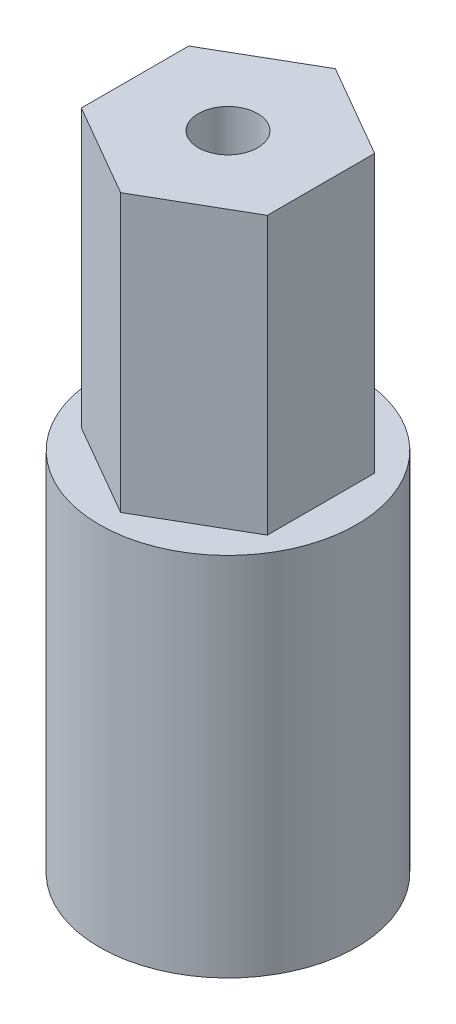
ISO-10303-21;
HEADER;
FILE_DESCRIPTION(('STEP AP214'),'2;1');
FILE_NAME('part.step','',(''),(''),'','','');
FILE_SCHEMA(('AUTOMOTIVE_DESIGN { 1 0 10303 214 1 1 1 1 }'));
ENDSEC;
DATA;
#1=APPLICATION_CONTEXT('core data for automotive mechanical design processes');
#2=APPLICATION_PROTOCOL_DEFINITION('international standard','automotive_design',2000,#1);
#3=PRODUCT_CONTEXT('',#1,'mechanical');
#4=PRODUCT('Part','Part','',(#3));
#5=PRODUCT_RELATED_PRODUCT_CATEGORY('part','',(#4));
#6=PRODUCT_DEFINITION_FORMATION('','',#4);
#7=PRODUCT_DEFINITION_CONTEXT('part definition',#1,'design');
#8=PRODUCT_DEFINITION('design','',#6,#7);
#9=PRODUCT_DEFINITION_SHAPE('','',#8);
#10=(LENGTH_UNIT() NAMED_UNIT(*) SI_UNIT(.MILLI.,.METRE.));
#11=(NAMED_UNIT(*) PLANE_ANGLE_UNIT() SI_UNIT($,.RADIAN.));
#12=(NAMED_UNIT(*) SI_UNIT($,.STERADIAN.) SOLID_ANGLE_UNIT());
#13=UNCERTAINTY_MEASURE_WITH_UNIT(LENGTH_MEASURE(1.E-05),#10,'distance_accuracy_value','');
#14=(GEOMETRIC_REPRESENTATION_CONTEXT(3) GLOBAL_UNCERTAINTY_ASSIGNED_CONTEXT((#13)) GLOBAL_UNIT_ASSIGNED_CONTEXT((#10,
#11,#12)) REPRESENTATION_CONTEXT('',''));
#15=CARTESIAN_POINT('',(0.,0.,0.));
#16=DIRECTION('',(0.,0.,1.));
#17=DIRECTION('',(1.,0.,0.));
#18=AXIS2_PLACEMENT_3D('',#15,#16,#17);
#19=CARTESIAN_POINT('',(0.,23.495,0.));
#20=DIRECTION('',(0.,-1.,0.));
#21=DIRECTION('',(0.,0.,-1.));
#22=AXIS2_PLACEMENT_3D('',#19,#20,#21);
#23=CYLINDRICAL_SURFACE('',#22,8.255);
#24=CARTESIAN_POINT('',(0.,23.495,0.));
#25=DIRECTION('',(0.,1.,0.));
#26=DIRECTION('',(0.,0.,1.));
#27=AXIS2_PLACEMENT_3D('',#24,#25,#26);
#28=CIRCLE('',#27,8.255);
#29=CARTESIAN_POINT('',(0.,23.495,8.255));
#30=VERTEX_POINT('',#29);
#31=EDGE_CURVE('E39',#30,#30,#28,.T.);
#32=ORIENTED_EDGE('',*,*,#31,.F.);
#33=EDGE_LOOP('',(#32));
#34=FACE_BOUND('',#33,.T.);
#35=CARTESIAN_POINT('',(0.,0.,0.));
#36=DIRECTION('',(0.,1.,0.));
#37=DIRECTION('',(0.,0.,1.));
#38=AXIS2_PLACEMENT_3D('',#35,#36,#37);
#39=CIRCLE('',#38,8.255);
#40=CARTESIAN_POINT('',(0.,0.,8.255));
#41=VERTEX_POINT('',#40);
#42=EDGE_CURVE('E137',#41,#41,#39,.T.);
#43=ORIENTED_EDGE('',*,*,#42,.T.);
#44=EDGE_LOOP('',(#43));
#45=FACE_BOUND('',#44,.T.);
#46=ADVANCED_FACE('F32',(#34,#45),#23,.T.);
#47=CARTESIAN_POINT('',(0.,23.495,0.));
#48=DIRECTION('',(0.,1.,0.));
#49=DIRECTION('',(0.,0.,1.));
#50=AXIS2_PLACEMENT_3D('',#47,#48,#49);
#51=PLANE('',#50);
#52=DIRECTION('',(-0.866025403784439,0.,0.5));
#53=VECTOR('',#52,1.);
#54=CARTESIAN_POINT('',(0.,23.495,-6.89240751358575));
#55=LINE('',#54,#53);
#56=CARTESIAN_POINT('',(0.,23.495,-6.89240751358575));
#57=VERTEX_POINT('',#56);
#58=CARTESIAN_POINT('',(-5.969,23.495,-3.44620375679288));
#59=VERTEX_POINT('',#58);
#60=EDGE_CURVE('E119',#57,#59,#55,.T.);
#61=ORIENTED_EDGE('',*,*,#60,.F.);
#62=DIRECTION('',(-0.866025403784439,0.,-0.5));
#63=VECTOR('',#62,1.);
#64=CARTESIAN_POINT('',(5.969,23.495,-3.44620375679288));
#65=LINE('',#64,#63);
#66=CARTESIAN_POINT('',(5.969,23.495,-3.44620375679288));
#67=VERTEX_POINT('',#66);
#68=EDGE_CURVE('E116',#67,#57,#65,.T.);
#69=ORIENTED_EDGE('',*,*,#68,.F.);
#70=DIRECTION('',(0.,0.,-1.));
#71=VECTOR('',#70,1.);
#72=CARTESIAN_POINT('',(5.969,23.495,3.44620375679288));
#73=LINE('',#72,#71);
#74=CARTESIAN_POINT('',(5.969,23.495,3.44620375679288));
#75=VERTEX_POINT('',#74);
#76=EDGE_CURVE('E74',#75,#67,#73,.T.);
#77=ORIENTED_EDGE('',*,*,#76,.F.);
#78=DIRECTION('',(0.866025403784439,0.,-0.5));
#79=VECTOR('',#78,1.);
#80=CARTESIAN_POINT('',(0.,23.495,6.89240751358575));
#81=LINE('',#80,#79);
#82=CARTESIAN_POINT('',(0.,23.495,6.89240751358575));
#83=VERTEX_POINT('',#82);
#84=EDGE_CURVE('E125',#83,#75,#81,.T.);
#85=ORIENTED_EDGE('',*,*,#84,.F.);
#86=DIRECTION('',(0.866025403784439,0.,0.5));
#87=VECTOR('',#86,1.);
#88=CARTESIAN_POINT('',(-5.969,23.495,3.44620375679288));
#89=LINE('',#88,#87);
#90=CARTESIAN_POINT('',(-5.969,23.495,3.44620375679288));
#91=VERTEX_POINT('',#90);
#92=EDGE_CURVE('E105',#91,#83,#89,.T.);
#93=ORIENTED_EDGE('',*,*,#92,.F.);
#94=DIRECTION('',(0.,0.,1.));
#95=VECTOR('',#94,1.);
#96=CARTESIAN_POINT('',(-5.969,23.495,-3.44620375679288));
#97=LINE('',#96,#95);
#98=EDGE_CURVE('E122',#59,#91,#97,.T.);
#99=ORIENTED_EDGE('',*,*,#98,.F.);
#100=EDGE_LOOP('',(#61,#69,#77,#85,#93,#99));
#101=FACE_BOUND('',#100,.T.);
#102=ORIENTED_EDGE('',*,*,#31,.T.);
#103=EDGE_LOOP('',(#102));
#104=FACE_BOUND('',#103,.T.);
#105=ADVANCED_FACE('F145',(#101,#104),#51,.T.);
#106=CARTESIAN_POINT('',(0.,0.,0.));
#107=DIRECTION('',(0.,1.,0.));
#108=DIRECTION('',(0.,0.,1.));
#109=AXIS2_PLACEMENT_3D('',#106,#107,#108);
#110=PLANE('',#109);
#111=ORIENTED_EDGE('',*,*,#42,.F.);
#112=EDGE_LOOP('',(#111));
#113=FACE_BOUND('',#112,.T.);
#114=ADVANCED_FACE('F143',(#113),#110,.F.);
#115=CARTESIAN_POINT('',(0.,41.275,0.));
#116=DIRECTION('',(0.,1.,0.));
#117=DIRECTION('',(0.,0.,1.));
#118=AXIS2_PLACEMENT_3D('',#115,#116,#117);
#119=PLANE('',#118);
#120=DIRECTION('',(-0.866025403784439,0.,-0.5));
#121=VECTOR('',#120,1.);
#122=CARTESIAN_POINT('',(5.969,41.275,-3.44620375679288));
#123=LINE('',#122,#121);
#124=CARTESIAN_POINT('',(5.969,41.275,-3.44620375679288));
#125=VERTEX_POINT('',#124);
#126=CARTESIAN_POINT('',(0.,41.275,-6.89240751358575));
#127=VERTEX_POINT('',#126);
#128=EDGE_CURVE('E128',#125,#127,#123,.T.);
#129=ORIENTED_EDGE('',*,*,#128,.T.);
#130=DIRECTION('',(-0.866025403784439,0.,0.5));
#131=VECTOR('',#130,1.);
#132=CARTESIAN_POINT('',(0.,41.275,-6.89240751358575));
#133=LINE('',#132,#131);
#134=CARTESIAN_POINT('',(-5.969,41.275,-3.44620375679288));
#135=VERTEX_POINT('',#134);
#136=EDGE_CURVE('E82',#127,#135,#133,.T.);
#137=ORIENTED_EDGE('',*,*,#136,.T.);
#138=DIRECTION('',(0.,0.,1.));
#139=VECTOR('',#138,1.);
#140=CARTESIAN_POINT('',(-5.969,41.275,-3.44620375679288));
#141=LINE('',#140,#139);
#142=CARTESIAN_POINT('',(-5.969,41.275,3.44620375679288));
#143=VERTEX_POINT('',#142);
#144=EDGE_CURVE('E96',#135,#143,#141,.T.);
#145=ORIENTED_EDGE('',*,*,#144,.T.);
#146=DIRECTION('',(0.866025403784439,0.,0.5));
#147=VECTOR('',#146,1.);
#148=CARTESIAN_POINT('',(-5.969,41.275,3.44620375679288));
#149=LINE('',#148,#147);
#150=CARTESIAN_POINT('',(0.,41.275,6.89240751358575));
#151=VERTEX_POINT('',#150);
#152=EDGE_CURVE('E89',#143,#151,#149,.T.);
#153=ORIENTED_EDGE('',*,*,#152,.T.);
#154=DIRECTION('',(0.866025403784439,0.,-0.5));
#155=VECTOR('',#154,1.);
#156=CARTESIAN_POINT('',(0.,41.275,6.89240751358575));
#157=LINE('',#156,#155);
#158=CARTESIAN_POINT('',(5.969,41.275,3.44620375679288));
#159=VERTEX_POINT('',#158);
#160=EDGE_CURVE('E94',#151,#159,#157,.T.);
#161=ORIENTED_EDGE('',*,*,#160,.T.);
#162=DIRECTION('',(0.,0.,-1.));
#163=VECTOR('',#162,1.);
#164=CARTESIAN_POINT('',(5.969,41.275,3.44620375679288));
#165=LINE('',#164,#163);
#166=EDGE_CURVE('E54',#159,#125,#165,.T.);
#167=ORIENTED_EDGE('',*,*,#166,.T.);
#168=EDGE_LOOP('',(#129,#137,#145,#153,#161,#167));
#169=FACE_BOUND('',#168,.T.);
#170=CARTESIAN_POINT('',(0.,41.275,0.));
#171=DIRECTION('',(0.,1.,0.));
#172=DIRECTION('',(0.,0.,1.));
#173=AXIS2_PLACEMENT_3D('',#170,#171,#172);
#174=CIRCLE('',#173,1.905);
#175=CARTESIAN_POINT('',(0.,41.275,1.905));
#176=VERTEX_POINT('',#175);
#177=EDGE_CURVE('E120',#176,#176,#174,.T.);
#178=ORIENTED_EDGE('',*,*,#177,.F.);
#179=EDGE_LOOP('',(#178));
#180=FACE_BOUND('',#179,.T.);
#181=ADVANCED_FACE('F91',(#169,#180),#119,.T.);
#182=CARTESIAN_POINT('',(5.969,41.275,-3.44620375679288));
#183=DIRECTION('',(-0.5,0.,0.866025403784439));
#184=DIRECTION('',(0.866025403784439,0.,0.5));
#185=AXIS2_PLACEMENT_3D('',#182,#183,#184);
#186=PLANE('',#185);
#187=ORIENTED_EDGE('',*,*,#68,.T.);
#188=DIRECTION('',(0.,-1.,0.));
#189=VECTOR('',#188,1.);
#190=CARTESIAN_POINT('',(0.,41.275,-6.89240751358575));
#191=LINE('',#190,#189);
#192=EDGE_CURVE('E135',#127,#57,#191,.T.);
#193=ORIENTED_EDGE('',*,*,#192,.F.);
#194=ORIENTED_EDGE('',*,*,#128,.F.);
#195=DIRECTION('',(0.,-1.,0.));
#196=VECTOR('',#195,1.);
#197=CARTESIAN_POINT('',(5.969,41.275,-3.44620375679288));
#198=LINE('',#197,#196);
#199=EDGE_CURVE('E112',#125,#67,#198,.T.);
#200=ORIENTED_EDGE('',*,*,#199,.T.);
#201=EDGE_LOOP('',(#187,#193,#194,#200));
#202=FACE_BOUND('',#201,.T.);
#203=ADVANCED_FACE('F150',(#202),#186,.F.);
#204=CARTESIAN_POINT('',(0.,41.275,-6.89240751358575));
#205=DIRECTION('',(0.5,0.,0.866025403784439));
#206=DIRECTION('',(0.866025403784439,0.,-0.5));
#207=AXIS2_PLACEMENT_3D('',#204,#205,#206);
#208=PLANE('',#207);
#209=ORIENTED_EDGE('',*,*,#60,.T.);
#210=DIRECTION('',(0.,-1.,0.));
#211=VECTOR('',#210,1.);
#212=CARTESIAN_POINT('',(-5.969,41.275,-3.44620375679288));
#213=LINE('',#212,#211);
#214=EDGE_CURVE('E132',#135,#59,#213,.T.);
#215=ORIENTED_EDGE('',*,*,#214,.F.);
#216=ORIENTED_EDGE('',*,*,#136,.F.);
#217=ORIENTED_EDGE('',*,*,#192,.T.);
#218=EDGE_LOOP('',(#209,#215,#216,#217));
#219=FACE_BOUND('',#218,.T.);
#220=ADVANCED_FACE('F183',(#219),#208,.F.);
#221=CARTESIAN_POINT('',(-5.969,41.275,-3.44620375679288));
#222=DIRECTION('',(1.,0.,0.));
#223=DIRECTION('',(0.,0.,-1.));
#224=AXIS2_PLACEMENT_3D('',#221,#222,#223);
#225=PLANE('',#224);
#226=ORIENTED_EDGE('',*,*,#98,.T.);
#227=DIRECTION('',(0.,-1.,0.));
#228=VECTOR('',#227,1.);
#229=CARTESIAN_POINT('',(-5.969,41.275,3.44620375679288));
#230=LINE('',#229,#228);
#231=EDGE_CURVE('E108',#143,#91,#230,.T.);
#232=ORIENTED_EDGE('',*,*,#231,.F.);
#233=ORIENTED_EDGE('',*,*,#144,.F.);
#234=ORIENTED_EDGE('',*,*,#214,.T.);
#235=EDGE_LOOP('',(#226,#232,#233,#234));
#236=FACE_BOUND('',#235,.T.);
#237=ADVANCED_FACE('F193',(#236),#225,.F.);
#238=CARTESIAN_POINT('',(-5.969,41.275,3.44620375679288));
#239=DIRECTION('',(0.5,0.,-0.866025403784439));
#240=DIRECTION('',(-0.866025403784439,0.,-0.5));
#241=AXIS2_PLACEMENT_3D('',#238,#239,#240);
#242=PLANE('',#241);
#243=ORIENTED_EDGE('',*,*,#92,.T.);
#244=DIRECTION('',(0.,-1.,0.));
#245=VECTOR('',#244,1.);
#246=CARTESIAN_POINT('',(0.,41.275,6.89240751358575));
#247=LINE('',#246,#245);
#248=EDGE_CURVE('E102',#151,#83,#247,.T.);
#249=ORIENTED_EDGE('',*,*,#248,.F.);
#250=ORIENTED_EDGE('',*,*,#152,.F.);
#251=ORIENTED_EDGE('',*,*,#231,.T.);
#252=EDGE_LOOP('',(#243,#249,#250,#251));
#253=FACE_BOUND('',#252,.T.);
#254=ADVANCED_FACE('F103',(#253),#242,.F.);
#255=CARTESIAN_POINT('',(0.,41.275,6.89240751358575));
#256=DIRECTION('',(-0.5,0.,-0.866025403784439));
#257=DIRECTION('',(-0.866025403784439,0.,0.5));
#258=AXIS2_PLACEMENT_3D('',#255,#256,#257);
#259=PLANE('',#258);
#260=ORIENTED_EDGE('',*,*,#84,.T.);
#261=DIRECTION('',(0.,-1.,0.));
#262=VECTOR('',#261,1.);
#263=CARTESIAN_POINT('',(5.969,41.275,3.44620375679288));
#264=LINE('',#263,#262);
#265=EDGE_CURVE('E46',#159,#75,#264,.T.);
#266=ORIENTED_EDGE('',*,*,#265,.F.);
#267=ORIENTED_EDGE('',*,*,#160,.F.);
#268=ORIENTED_EDGE('',*,*,#248,.T.);
#269=EDGE_LOOP('',(#260,#266,#267,#268));
#270=FACE_BOUND('',#269,.T.);
#271=ADVANCED_FACE('F110',(#270),#259,.F.);
#272=CARTESIAN_POINT('',(5.969,41.275,3.44620375679288));
#273=DIRECTION('',(-1.,0.,0.));
#274=DIRECTION('',(0.,0.,1.));
#275=AXIS2_PLACEMENT_3D('',#272,#273,#274);
#276=PLANE('',#275);
#277=ORIENTED_EDGE('',*,*,#76,.T.);
#278=ORIENTED_EDGE('',*,*,#199,.F.);
#279=ORIENTED_EDGE('',*,*,#166,.F.);
#280=ORIENTED_EDGE('',*,*,#265,.T.);
#281=EDGE_LOOP('',(#277,#278,#279,#280));
#282=FACE_BOUND('',#281,.T.);
#283=ADVANCED_FACE('F219',(#282),#276,.F.);
#284=CARTESIAN_POINT('',(0.,41.275,0.));
#285=DIRECTION('',(0.,-1.,0.));
#286=DIRECTION('',(0.,0.,-1.));
#287=AXIS2_PLACEMENT_3D('',#284,#285,#286);
#288=CYLINDRICAL_SURFACE('',#287,1.905);
#289=ORIENTED_EDGE('',*,*,#177,.T.);
#290=EDGE_LOOP('',(#289));
#291=FACE_BOUND('',#290,.T.);
#292=CARTESIAN_POINT('',(0.,23.495,0.));
#293=DIRECTION('',(0.,1.,0.));
#294=DIRECTION('',(0.,0.,1.));
#295=AXIS2_PLACEMENT_3D('',#292,#293,#294);
#296=CIRCLE('',#295,1.905);
#297=CARTESIAN_POINT('',(0.,23.495,1.905));
#298=VERTEX_POINT('',#297);
#299=EDGE_CURVE('E11',#298,#298,#296,.F.);
#300=ORIENTED_EDGE('',*,*,#299,.T.);
#301=EDGE_LOOP('',(#300));
#302=FACE_BOUND('',#301,.T.);
#303=ADVANCED_FACE('F228',(#291,#302),#288,.F.);
#304=ORIENTED_EDGE('',*,*,#299,.F.);
#305=EDGE_LOOP('',(#304));
#306=FACE_BOUND('',#305,.T.);
#307=ADVANCED_FACE('F154',(#306),#51,.T.);
#308=CLOSED_SHELL('',(#46,#105,#114,#181,#203,#220,#237,#254,#271,#283,#303,#307));
#309=MANIFOLD_SOLID_BREP('B2',#308);
#310=ADVANCED_BREP_SHAPE_REPRESENTATION('',(#18,#309),#14);
#311=SHAPE_DEFINITION_REPRESENTATION(#9,#310);
ENDSEC;
END-ISO-10303-21;
